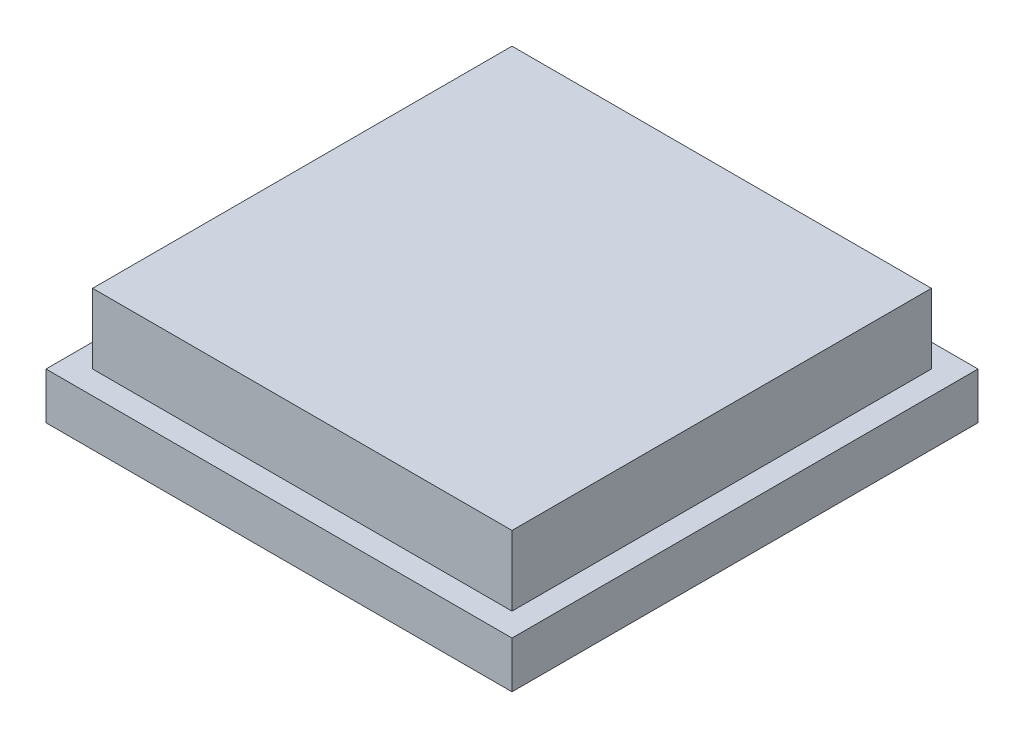
ISO-10303-21;
HEADER;
FILE_DESCRIPTION(('STEP AP214'),'2;1');
FILE_NAME('part.step','',(''),(''),'','','');
FILE_SCHEMA(('AUTOMOTIVE_DESIGN { 1 0 10303 214 1 1 1 1 }'));
ENDSEC;
DATA;
#1=APPLICATION_CONTEXT('core data for automotive mechanical design processes');
#2=APPLICATION_PROTOCOL_DEFINITION('international standard','automotive_design',2000,#1);
#3=PRODUCT_CONTEXT('',#1,'mechanical');
#4=PRODUCT('Part','Part','',(#3));
#5=PRODUCT_RELATED_PRODUCT_CATEGORY('part','',(#4));
#6=PRODUCT_DEFINITION_FORMATION('','',#4);
#7=PRODUCT_DEFINITION_CONTEXT('part definition',#1,'design');
#8=PRODUCT_DEFINITION('design','',#6,#7);
#9=PRODUCT_DEFINITION_SHAPE('','',#8);
#10=(LENGTH_UNIT() NAMED_UNIT(*) SI_UNIT(.MILLI.,.METRE.));
#11=(NAMED_UNIT(*) PLANE_ANGLE_UNIT() SI_UNIT($,.RADIAN.));
#12=(NAMED_UNIT(*) SI_UNIT($,.STERADIAN.) SOLID_ANGLE_UNIT());
#13=UNCERTAINTY_MEASURE_WITH_UNIT(LENGTH_MEASURE(1.E-05),#10,'distance_accuracy_value','');
#14=(GEOMETRIC_REPRESENTATION_CONTEXT(3) GLOBAL_UNCERTAINTY_ASSIGNED_CONTEXT((#13)) GLOBAL_UNIT_ASSIGNED_CONTEXT((#10,
#11,#12)) REPRESENTATION_CONTEXT('',''));
#15=CARTESIAN_POINT('',(0.,0.,0.));
#16=DIRECTION('',(0.,0.,1.));
#17=DIRECTION('',(1.,0.,0.));
#18=AXIS2_PLACEMENT_3D('',#15,#16,#17);
#19=CARTESIAN_POINT('',(0.,1.,0.));
#20=DIRECTION('',(0.,-1.,0.));
#21=DIRECTION('',(0.,0.,-1.));
#22=AXIS2_PLACEMENT_3D('',#19,#20,#21);
#23=PLANE('',#22);
#24=DIRECTION('',(0.,0.,1.));
#25=VECTOR('',#24,1.);
#26=CARTESIAN_POINT('',(-5.,1.,-5.));
#27=LINE('',#26,#25);
#28=CARTESIAN_POINT('',(-5.,1.,-5.));
#29=VERTEX_POINT('',#28);
#30=CARTESIAN_POINT('',(-5.,1.,5.));
#31=VERTEX_POINT('',#30);
#32=EDGE_CURVE('E149',#29,#31,#27,.T.);
#33=ORIENTED_EDGE('',*,*,#32,.T.);
#34=DIRECTION('',(1.,0.,0.));
#35=VECTOR('',#34,1.);
#36=CARTESIAN_POINT('',(5.,1.,5.));
#37=LINE('',#36,#35);
#38=CARTESIAN_POINT('',(5.,1.,5.));
#39=VERTEX_POINT('',#38);
#40=EDGE_CURVE('E153',#31,#39,#37,.T.);
#41=ORIENTED_EDGE('',*,*,#40,.T.);
#42=DIRECTION('',(0.,0.,-1.));
#43=VECTOR('',#42,1.);
#44=CARTESIAN_POINT('',(5.,1.,-5.));
#45=LINE('',#44,#43);
#46=CARTESIAN_POINT('',(5.,1.,-5.));
#47=VERTEX_POINT('',#46);
#48=EDGE_CURVE('E157',#39,#47,#45,.T.);
#49=ORIENTED_EDGE('',*,*,#48,.T.);
#50=DIRECTION('',(-1.,0.,0.));
#51=VECTOR('',#50,1.);
#52=CARTESIAN_POINT('',(5.,1.,-5.));
#53=LINE('',#52,#51);
#54=EDGE_CURVE('E160',#47,#29,#53,.T.);
#55=ORIENTED_EDGE('',*,*,#54,.T.);
#56=EDGE_LOOP('',(#33,#41,#49,#55));
#57=FACE_BOUND('',#56,.T.);
#58=DIRECTION('',(0.,0.,1.));
#59=VECTOR('',#58,1.);
#60=CARTESIAN_POINT('',(-4.5,1.,0.));
#61=LINE('',#60,#59);
#62=CARTESIAN_POINT('',(-4.5,1.,-4.5));
#63=VERTEX_POINT('',#62);
#64=CARTESIAN_POINT('',(-4.5,1.,4.5));
#65=VERTEX_POINT('',#64);
#66=EDGE_CURVE('E128',#63,#65,#61,.T.);
#67=ORIENTED_EDGE('',*,*,#66,.F.);
#68=DIRECTION('',(-1.,0.,0.));
#69=VECTOR('',#68,1.);
#70=CARTESIAN_POINT('',(0.,1.,-4.5));
#71=LINE('',#70,#69);
#72=CARTESIAN_POINT('',(4.5,1.,-4.5));
#73=VERTEX_POINT('',#72);
#74=EDGE_CURVE('E130',#73,#63,#71,.T.);
#75=ORIENTED_EDGE('',*,*,#74,.F.);
#76=DIRECTION('',(0.,0.,-1.));
#77=VECTOR('',#76,1.);
#78=CARTESIAN_POINT('',(4.5,1.,0.));
#79=LINE('',#78,#77);
#80=CARTESIAN_POINT('',(4.5,1.,4.5));
#81=VERTEX_POINT('',#80);
#82=EDGE_CURVE('E62',#81,#73,#79,.T.);
#83=ORIENTED_EDGE('',*,*,#82,.F.);
#84=DIRECTION('',(1.,0.,0.));
#85=VECTOR('',#84,1.);
#86=CARTESIAN_POINT('',(0.,1.,4.5));
#87=LINE('',#86,#85);
#88=EDGE_CURVE('E57',#65,#81,#87,.T.);
#89=ORIENTED_EDGE('',*,*,#88,.F.);
#90=EDGE_LOOP('',(#67,#75,#83,#89));
#91=FACE_BOUND('',#90,.T.);
#92=ADVANCED_FACE('F41',(#57,#91),#23,.F.);
#93=CARTESIAN_POINT('',(-5.,1.,-5.));
#94=DIRECTION('',(1.,0.,0.));
#95=DIRECTION('',(0.,0.,-1.));
#96=AXIS2_PLACEMENT_3D('',#93,#94,#95);
#97=PLANE('',#96);
#98=DIRECTION('',(0.,0.,1.));
#99=VECTOR('',#98,1.);
#100=CARTESIAN_POINT('',(-5.,0.,-5.));
#101=LINE('',#100,#99);
#102=CARTESIAN_POINT('',(-5.,0.,-5.));
#103=VERTEX_POINT('',#102);
#104=CARTESIAN_POINT('',(-5.,0.,5.));
#105=VERTEX_POINT('',#104);
#106=EDGE_CURVE('E148',#103,#105,#101,.T.);
#107=ORIENTED_EDGE('',*,*,#106,.T.);
#108=DIRECTION('',(0.,-1.,0.));
#109=VECTOR('',#108,1.);
#110=CARTESIAN_POINT('',(-5.,1.,5.));
#111=LINE('',#110,#109);
#112=EDGE_CURVE('E11',#31,#105,#111,.T.);
#113=ORIENTED_EDGE('',*,*,#112,.F.);
#114=ORIENTED_EDGE('',*,*,#32,.F.);
#115=DIRECTION('',(0.,-1.,0.));
#116=VECTOR('',#115,1.);
#117=CARTESIAN_POINT('',(-5.,1.,-5.));
#118=LINE('',#117,#116);
#119=EDGE_CURVE('E163',#29,#103,#118,.T.);
#120=ORIENTED_EDGE('',*,*,#119,.T.);
#121=EDGE_LOOP('',(#107,#113,#114,#120));
#122=FACE_BOUND('',#121,.T.);
#123=ADVANCED_FACE('F43',(#122),#97,.F.);
#124=CARTESIAN_POINT('',(5.,1.,5.));
#125=DIRECTION('',(0.,0.,-1.));
#126=DIRECTION('',(-1.,0.,0.));
#127=AXIS2_PLACEMENT_3D('',#124,#125,#126);
#128=PLANE('',#127);
#129=DIRECTION('',(1.,0.,0.));
#130=VECTOR('',#129,1.);
#131=CARTESIAN_POINT('',(5.,0.,5.));
#132=LINE('',#131,#130);
#133=CARTESIAN_POINT('',(5.,0.,5.));
#134=VERTEX_POINT('',#133);
#135=EDGE_CURVE('E167',#105,#134,#132,.T.);
#136=ORIENTED_EDGE('',*,*,#135,.T.);
#137=DIRECTION('',(0.,-1.,0.));
#138=VECTOR('',#137,1.);
#139=CARTESIAN_POINT('',(5.,1.,5.));
#140=LINE('',#139,#138);
#141=EDGE_CURVE('E50',#39,#134,#140,.T.);
#142=ORIENTED_EDGE('',*,*,#141,.F.);
#143=ORIENTED_EDGE('',*,*,#40,.F.);
#144=ORIENTED_EDGE('',*,*,#112,.T.);
#145=EDGE_LOOP('',(#136,#142,#143,#144));
#146=FACE_BOUND('',#145,.T.);
#147=ADVANCED_FACE('F202',(#146),#128,.F.);
#148=CARTESIAN_POINT('',(5.,1.,-5.));
#149=DIRECTION('',(-1.,0.,0.));
#150=DIRECTION('',(0.,0.,1.));
#151=AXIS2_PLACEMENT_3D('',#148,#149,#150);
#152=PLANE('',#151);
#153=DIRECTION('',(0.,0.,-1.));
#154=VECTOR('',#153,1.);
#155=CARTESIAN_POINT('',(5.,0.,-5.));
#156=LINE('',#155,#154);
#157=CARTESIAN_POINT('',(5.,0.,-5.));
#158=VERTEX_POINT('',#157);
#159=EDGE_CURVE('E170',#134,#158,#156,.T.);
#160=ORIENTED_EDGE('',*,*,#159,.T.);
#161=DIRECTION('',(0.,-1.,0.));
#162=VECTOR('',#161,1.);
#163=CARTESIAN_POINT('',(5.,1.,-5.));
#164=LINE('',#163,#162);
#165=EDGE_CURVE('E177',#47,#158,#164,.T.);
#166=ORIENTED_EDGE('',*,*,#165,.F.);
#167=ORIENTED_EDGE('',*,*,#48,.F.);
#168=ORIENTED_EDGE('',*,*,#141,.T.);
#169=EDGE_LOOP('',(#160,#166,#167,#168));
#170=FACE_BOUND('',#169,.T.);
#171=ADVANCED_FACE('F187',(#170),#152,.F.);
#172=CARTESIAN_POINT('',(5.,1.,-5.));
#173=DIRECTION('',(0.,0.,1.));
#174=DIRECTION('',(1.,0.,0.));
#175=AXIS2_PLACEMENT_3D('',#172,#173,#174);
#176=PLANE('',#175);
#177=DIRECTION('',(-1.,0.,0.));
#178=VECTOR('',#177,1.);
#179=CARTESIAN_POINT('',(5.,0.,-5.));
#180=LINE('',#179,#178);
#181=EDGE_CURVE('E154',#158,#103,#180,.T.);
#182=ORIENTED_EDGE('',*,*,#181,.T.);
#183=ORIENTED_EDGE('',*,*,#119,.F.);
#184=ORIENTED_EDGE('',*,*,#54,.F.);
#185=ORIENTED_EDGE('',*,*,#165,.T.);
#186=EDGE_LOOP('',(#182,#183,#184,#185));
#187=FACE_BOUND('',#186,.T.);
#188=ADVANCED_FACE('F196',(#187),#176,.F.);
#189=CARTESIAN_POINT('',(0.,0.,0.));
#190=DIRECTION('',(0.,-1.,0.));
#191=DIRECTION('',(0.,0.,-1.));
#192=AXIS2_PLACEMENT_3D('',#189,#190,#191);
#193=PLANE('',#192);
#194=ORIENTED_EDGE('',*,*,#106,.F.);
#195=ORIENTED_EDGE('',*,*,#181,.F.);
#196=ORIENTED_EDGE('',*,*,#159,.F.);
#197=ORIENTED_EDGE('',*,*,#135,.F.);
#198=EDGE_LOOP('',(#194,#195,#196,#197));
#199=FACE_BOUND('',#198,.T.);
#200=ADVANCED_FACE('F193',(#199),#193,.T.);
#201=CARTESIAN_POINT('',(-4.5,2.5,-4.5));
#202=DIRECTION('',(1.,0.,0.));
#203=DIRECTION('',(0.,0.,-1.));
#204=AXIS2_PLACEMENT_3D('',#201,#202,#203);
#205=PLANE('',#204);
#206=DIRECTION('',(0.,-1.,0.));
#207=VECTOR('',#206,1.);
#208=CARTESIAN_POINT('',(-4.5,2.5,-4.5));
#209=LINE('',#208,#207);
#210=CARTESIAN_POINT('',(-4.5,2.5,-4.5));
#211=VERTEX_POINT('',#210);
#212=EDGE_CURVE('E307',#211,#63,#209,.T.);
#213=ORIENTED_EDGE('',*,*,#212,.T.);
#214=ORIENTED_EDGE('',*,*,#66,.T.);
#215=DIRECTION('',(0.,-1.,0.));
#216=VECTOR('',#215,1.);
#217=CARTESIAN_POINT('',(-4.5,2.5,4.5));
#218=LINE('',#217,#216);
#219=CARTESIAN_POINT('',(-4.5,2.5,4.5));
#220=VERTEX_POINT('',#219);
#221=EDGE_CURVE('E109',#220,#65,#218,.T.);
#222=ORIENTED_EDGE('',*,*,#221,.F.);
#223=DIRECTION('',(0.,0.,1.));
#224=VECTOR('',#223,1.);
#225=CARTESIAN_POINT('',(-4.5,2.5,-4.5));
#226=LINE('',#225,#224);
#227=EDGE_CURVE('E116',#211,#220,#226,.T.);
#228=ORIENTED_EDGE('',*,*,#227,.F.);
#229=EDGE_LOOP('',(#213,#214,#222,#228));
#230=FACE_BOUND('',#229,.T.);
#231=ADVANCED_FACE('F127',(#230),#205,.F.);
#232=CARTESIAN_POINT('',(4.5,2.5,4.5));
#233=DIRECTION('',(0.,0.,-1.));
#234=DIRECTION('',(-1.,0.,0.));
#235=AXIS2_PLACEMENT_3D('',#232,#233,#234);
#236=PLANE('',#235);
#237=ORIENTED_EDGE('',*,*,#221,.T.);
#238=ORIENTED_EDGE('',*,*,#88,.T.);
#239=DIRECTION('',(0.,-1.,0.));
#240=VECTOR('',#239,1.);
#241=CARTESIAN_POINT('',(4.5,2.5,4.5));
#242=LINE('',#241,#240);
#243=CARTESIAN_POINT('',(4.5,2.5,4.5));
#244=VERTEX_POINT('',#243);
#245=EDGE_CURVE('E111',#244,#81,#242,.T.);
#246=ORIENTED_EDGE('',*,*,#245,.F.);
#247=DIRECTION('',(1.,0.,0.));
#248=VECTOR('',#247,1.);
#249=CARTESIAN_POINT('',(4.5,2.5,4.5));
#250=LINE('',#249,#248);
#251=EDGE_CURVE('E105',#220,#244,#250,.T.);
#252=ORIENTED_EDGE('',*,*,#251,.F.);
#253=EDGE_LOOP('',(#237,#238,#246,#252));
#254=FACE_BOUND('',#253,.T.);
#255=ADVANCED_FACE('F107',(#254),#236,.F.);
#256=CARTESIAN_POINT('',(4.5,2.5,-4.5));
#257=DIRECTION('',(-1.,0.,0.));
#258=DIRECTION('',(0.,0.,1.));
#259=AXIS2_PLACEMENT_3D('',#256,#257,#258);
#260=PLANE('',#259);
#261=ORIENTED_EDGE('',*,*,#245,.T.);
#262=ORIENTED_EDGE('',*,*,#82,.T.);
#263=DIRECTION('',(0.,-1.,0.));
#264=VECTOR('',#263,1.);
#265=CARTESIAN_POINT('',(4.5,2.5,-4.5));
#266=LINE('',#265,#264);
#267=CARTESIAN_POINT('',(4.5,2.5,-4.5));
#268=VERTEX_POINT('',#267);
#269=EDGE_CURVE('E138',#268,#73,#266,.T.);
#270=ORIENTED_EDGE('',*,*,#269,.F.);
#271=DIRECTION('',(0.,0.,-1.));
#272=VECTOR('',#271,1.);
#273=CARTESIAN_POINT('',(4.5,2.5,-4.5));
#274=LINE('',#273,#272);
#275=EDGE_CURVE('E115',#244,#268,#274,.T.);
#276=ORIENTED_EDGE('',*,*,#275,.F.);
#277=EDGE_LOOP('',(#261,#262,#270,#276));
#278=FACE_BOUND('',#277,.T.);
#279=ADVANCED_FACE('F235',(#278),#260,.F.);
#280=CARTESIAN_POINT('',(4.5,2.5,-4.5));
#281=DIRECTION('',(0.,0.,1.));
#282=DIRECTION('',(1.,0.,0.));
#283=AXIS2_PLACEMENT_3D('',#280,#281,#282);
#284=PLANE('',#283);
#285=ORIENTED_EDGE('',*,*,#269,.T.);
#286=ORIENTED_EDGE('',*,*,#74,.T.);
#287=ORIENTED_EDGE('',*,*,#212,.F.);
#288=DIRECTION('',(-1.,0.,0.));
#289=VECTOR('',#288,1.);
#290=CARTESIAN_POINT('',(4.5,2.5,-4.5));
#291=LINE('',#290,#289);
#292=EDGE_CURVE('E121',#268,#211,#291,.T.);
#293=ORIENTED_EDGE('',*,*,#292,.F.);
#294=EDGE_LOOP('',(#285,#286,#287,#293));
#295=FACE_BOUND('',#294,.T.);
#296=ADVANCED_FACE('F240',(#295),#284,.F.);
#297=CARTESIAN_POINT('',(0.,2.5,0.));
#298=DIRECTION('',(0.,-1.,0.));
#299=DIRECTION('',(0.,0.,-1.));
#300=AXIS2_PLACEMENT_3D('',#297,#298,#299);
#301=PLANE('',#300);
#302=ORIENTED_EDGE('',*,*,#227,.T.);
#303=ORIENTED_EDGE('',*,*,#251,.T.);
#304=ORIENTED_EDGE('',*,*,#275,.T.);
#305=ORIENTED_EDGE('',*,*,#292,.T.);
#306=EDGE_LOOP('',(#302,#303,#304,#305));
#307=FACE_BOUND('',#306,.T.);
#308=ADVANCED_FACE('F119',(#307),#301,.F.);
#309=CLOSED_SHELL('',(#92,#123,#147,#171,#188,#200,#231,#255,#279,#296,#308));
#310=MANIFOLD_SOLID_BREP('B2',#309);
#311=ADVANCED_BREP_SHAPE_REPRESENTATION('',(#18,#310),#14);
#312=SHAPE_DEFINITION_REPRESENTATION(#9,#311);
ENDSEC;
END-ISO-10303-21;
